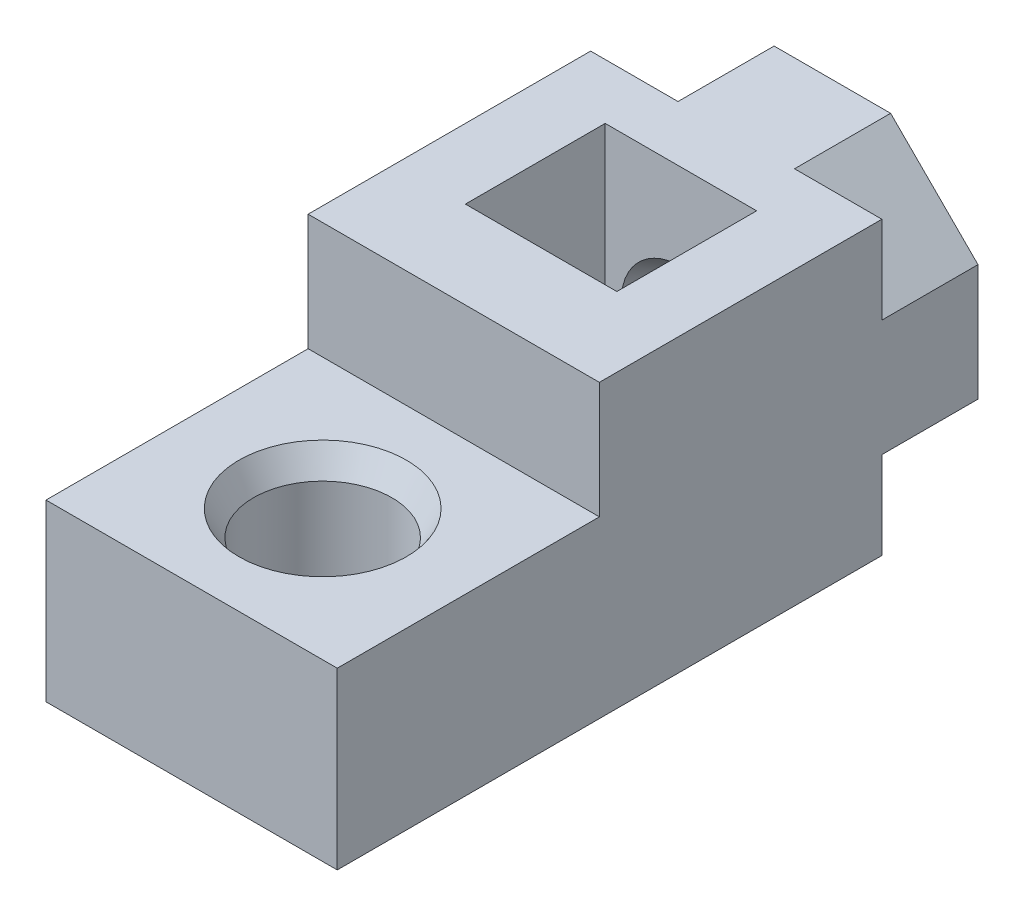
ISO-10303-21;
HEADER;
FILE_DESCRIPTION(('STEP AP214'),'2;1');
FILE_NAME('part.step','',(''),(''),'','','');
FILE_SCHEMA(('AUTOMOTIVE_DESIGN { 1 0 10303 214 1 1 1 1 }'));
ENDSEC;
DATA;
#1=APPLICATION_CONTEXT('core data for automotive mechanical design processes');
#2=APPLICATION_PROTOCOL_DEFINITION('international standard','automotive_design',2000,#1);
#3=PRODUCT_CONTEXT('',#1,'mechanical');
#4=PRODUCT('Part','Part','',(#3));
#5=PRODUCT_RELATED_PRODUCT_CATEGORY('part','',(#4));
#6=PRODUCT_DEFINITION_FORMATION('','',#4);
#7=PRODUCT_DEFINITION_CONTEXT('part definition',#1,'design');
#8=PRODUCT_DEFINITION('design','',#6,#7);
#9=PRODUCT_DEFINITION_SHAPE('','',#8);
#10=(LENGTH_UNIT() NAMED_UNIT(*) SI_UNIT(.MILLI.,.METRE.));
#11=(NAMED_UNIT(*) PLANE_ANGLE_UNIT() SI_UNIT($,.RADIAN.));
#12=(NAMED_UNIT(*) SI_UNIT($,.STERADIAN.) SOLID_ANGLE_UNIT());
#13=UNCERTAINTY_MEASURE_WITH_UNIT(LENGTH_MEASURE(1.E-05),#10,'distance_accuracy_value','');
#14=(GEOMETRIC_REPRESENTATION_CONTEXT(3) GLOBAL_UNCERTAINTY_ASSIGNED_CONTEXT((#13)) GLOBAL_UNIT_ASSIGNED_CONTEXT((#10,
#11,#12)) REPRESENTATION_CONTEXT('',''));
#15=CARTESIAN_POINT('',(0.,0.,0.));
#16=DIRECTION('',(0.,0.,1.));
#17=DIRECTION('',(1.,0.,0.));
#18=AXIS2_PLACEMENT_3D('',#15,#16,#17);
#19=CARTESIAN_POINT('',(0.,0.,22.));
#20=DIRECTION('',(0.,0.,1.));
#21=DIRECTION('',(1.,0.,0.));
#22=AXIS2_PLACEMENT_3D('',#19,#20,#21);
#23=PLANE('',#22);
#24=DIRECTION('',(0.,1.,0.));
#25=VECTOR('',#24,1.);
#26=CARTESIAN_POINT('',(5.,5.,22.));
#27=LINE('',#26,#25);
#28=CARTESIAN_POINT('',(5.,-5.,22.));
#29=VERTEX_POINT('',#28);
#30=CARTESIAN_POINT('',(5.,1.,22.));
#31=VERTEX_POINT('',#30);
#32=EDGE_CURVE('E320',#29,#31,#27,.T.);
#33=ORIENTED_EDGE('',*,*,#32,.T.);
#34=DIRECTION('',(1.,0.,0.));
#35=VECTOR('',#34,1.);
#36=CARTESIAN_POINT('',(5.,1.,22.));
#37=LINE('',#36,#35);
#38=CARTESIAN_POINT('',(-5.,1.,22.));
#39=VERTEX_POINT('',#38);
#40=EDGE_CURVE('E421',#39,#31,#37,.T.);
#41=ORIENTED_EDGE('',*,*,#40,.F.);
#42=DIRECTION('',(0.,-1.,0.));
#43=VECTOR('',#42,1.);
#44=CARTESIAN_POINT('',(-5.,5.,22.));
#45=LINE('',#44,#43);
#46=CARTESIAN_POINT('',(-5.,-5.,22.));
#47=VERTEX_POINT('',#46);
#48=EDGE_CURVE('E324',#39,#47,#45,.T.);
#49=ORIENTED_EDGE('',*,*,#48,.T.);
#50=DIRECTION('',(1.,0.,0.));
#51=VECTOR('',#50,1.);
#52=CARTESIAN_POINT('',(-5.,-5.,22.));
#53=LINE('',#52,#51);
#54=EDGE_CURVE('E199',#47,#29,#53,.T.);
#55=ORIENTED_EDGE('',*,*,#54,.T.);
#56=EDGE_LOOP('',(#33,#41,#49,#55));
#57=FACE_BOUND('',#56,.T.);
#58=ADVANCED_FACE('F41',(#57),#23,.T.);
#59=CARTESIAN_POINT('',(-5.,5.,22.));
#60=DIRECTION('',(0.,-1.,0.));
#61=DIRECTION('',(0.,0.,-1.));
#62=AXIS2_PLACEMENT_3D('',#59,#60,#61);
#63=PLANE('',#62);
#64=DIRECTION('',(1.,0.,0.));
#65=VECTOR('',#64,1.);
#66=CARTESIAN_POINT('',(2.,5.,3.3));
#67=LINE('',#66,#65);
#68=CARTESIAN_POINT('',(2.,5.,3.3));
#69=VERTEX_POINT('',#68);
#70=CARTESIAN_POINT('',(5.,5.,3.3));
#71=VERTEX_POINT('',#70);
#72=EDGE_CURVE('E375',#69,#71,#67,.T.);
#73=ORIENTED_EDGE('',*,*,#72,.F.);
#74=DIRECTION('',(0.,0.,-1.));
#75=VECTOR('',#74,1.);
#76=CARTESIAN_POINT('',(2.,5.,3.3));
#77=LINE('',#76,#75);
#78=CARTESIAN_POINT('',(2.,5.,0.));
#79=VERTEX_POINT('',#78);
#80=EDGE_CURVE('E357',#69,#79,#77,.T.);
#81=ORIENTED_EDGE('',*,*,#80,.T.);
#82=DIRECTION('',(-1.,0.,0.));
#83=VECTOR('',#82,1.);
#84=CARTESIAN_POINT('',(-5.,5.,0.));
#85=LINE('',#84,#83);
#86=CARTESIAN_POINT('',(-2.,5.,0.));
#87=VERTEX_POINT('',#86);
#88=EDGE_CURVE('E333',#79,#87,#85,.T.);
#89=ORIENTED_EDGE('',*,*,#88,.T.);
#90=DIRECTION('',(0.,0.,-1.));
#91=VECTOR('',#90,1.);
#92=CARTESIAN_POINT('',(-2.,5.,3.3));
#93=LINE('',#92,#91);
#94=CARTESIAN_POINT('',(-2.,5.,3.3));
#95=VERTEX_POINT('',#94);
#96=EDGE_CURVE('E58',#95,#87,#93,.T.);
#97=ORIENTED_EDGE('',*,*,#96,.F.);
#98=DIRECTION('',(1.,0.,0.));
#99=VECTOR('',#98,1.);
#100=CARTESIAN_POINT('',(-5.,5.,3.3));
#101=LINE('',#100,#99);
#102=CARTESIAN_POINT('',(-5.,5.,3.3));
#103=VERTEX_POINT('',#102);
#104=EDGE_CURVE('E393',#103,#95,#101,.T.);
#105=ORIENTED_EDGE('',*,*,#104,.F.);
#106=DIRECTION('',(0.,0.,-1.));
#107=VECTOR('',#106,1.);
#108=CARTESIAN_POINT('',(-5.,5.,22.));
#109=LINE('',#108,#107);
#110=CARTESIAN_POINT('',(-5.,5.,13.));
#111=VERTEX_POINT('',#110);
#112=EDGE_CURVE('E201',#111,#103,#109,.T.);
#113=ORIENTED_EDGE('',*,*,#112,.F.);
#114=DIRECTION('',(-1.,0.,0.));
#115=VECTOR('',#114,1.);
#116=CARTESIAN_POINT('',(5.,5.,13.));
#117=LINE('',#116,#115);
#118=CARTESIAN_POINT('',(5.,5.,13.));
#119=VERTEX_POINT('',#118);
#120=EDGE_CURVE('E407',#119,#111,#117,.T.);
#121=ORIENTED_EDGE('',*,*,#120,.F.);
#122=DIRECTION('',(0.,0.,-1.));
#123=VECTOR('',#122,1.);
#124=CARTESIAN_POINT('',(5.,5.,22.));
#125=LINE('',#124,#123);
#126=EDGE_CURVE('E207',#119,#71,#125,.T.);
#127=ORIENTED_EDGE('',*,*,#126,.T.);
#128=EDGE_LOOP('',(#73,#81,#89,#97,#105,#113,#121,#127));
#129=FACE_BOUND('',#128,.T.);
#130=DIRECTION('',(1.,0.,0.));
#131=VECTOR('',#130,1.);
#132=CARTESIAN_POINT('',(-5.,5.,10.));
#133=LINE('',#132,#131);
#134=CARTESIAN_POINT('',(-2.6,5.,10.));
#135=VERTEX_POINT('',#134);
#136=CARTESIAN_POINT('',(2.6,5.,10.));
#137=VERTEX_POINT('',#136);
#138=EDGE_CURVE('E228',#135,#137,#133,.T.);
#139=ORIENTED_EDGE('',*,*,#138,.F.);
#140=DIRECTION('',(0.,0.,-1.));
#141=VECTOR('',#140,1.);
#142=CARTESIAN_POINT('',(-2.6,5.,22.));
#143=LINE('',#142,#141);
#144=CARTESIAN_POINT('',(-2.6,5.,5.2));
#145=VERTEX_POINT('',#144);
#146=EDGE_CURVE('E220',#135,#145,#143,.T.);
#147=ORIENTED_EDGE('',*,*,#146,.T.);
#148=DIRECTION('',(1.,0.,0.));
#149=VECTOR('',#148,1.);
#150=CARTESIAN_POINT('',(-5.,5.,5.2));
#151=LINE('',#150,#149);
#152=CARTESIAN_POINT('',(2.6,5.,5.2));
#153=VERTEX_POINT('',#152);
#154=EDGE_CURVE('E216',#145,#153,#151,.T.);
#155=ORIENTED_EDGE('',*,*,#154,.T.);
#156=DIRECTION('',(0.,0.,1.));
#157=VECTOR('',#156,1.);
#158=CARTESIAN_POINT('',(2.6,5.,22.));
#159=LINE('',#158,#157);
#160=EDGE_CURVE('E224',#153,#137,#159,.T.);
#161=ORIENTED_EDGE('',*,*,#160,.T.);
#162=EDGE_LOOP('',(#139,#147,#155,#161));
#163=FACE_BOUND('',#162,.T.);
#164=ADVANCED_FACE('F446',(#129,#163),#63,.F.);
#165=CARTESIAN_POINT('',(5.,5.,22.));
#166=DIRECTION('',(-1.,0.,0.));
#167=DIRECTION('',(0.,-1.,0.));
#168=AXIS2_PLACEMENT_3D('',#165,#166,#167);
#169=PLANE('',#168);
#170=DIRECTION('',(0.,1.,0.));
#171=VECTOR('',#170,1.);
#172=CARTESIAN_POINT('',(5.,5.,0.));
#173=LINE('',#172,#171);
#174=CARTESIAN_POINT('',(5.,-2.,0.));
#175=VERTEX_POINT('',#174);
#176=CARTESIAN_POINT('',(5.,2.,0.));
#177=VERTEX_POINT('',#176);
#178=EDGE_CURVE('E316',#175,#177,#173,.T.);
#179=ORIENTED_EDGE('',*,*,#178,.T.);
#180=DIRECTION('',(0.,0.,-1.));
#181=VECTOR('',#180,1.);
#182=CARTESIAN_POINT('',(5.,2.,3.3));
#183=LINE('',#182,#181);
#184=CARTESIAN_POINT('',(5.,2.,3.3));
#185=VERTEX_POINT('',#184);
#186=EDGE_CURVE('E364',#185,#177,#183,.T.);
#187=ORIENTED_EDGE('',*,*,#186,.F.);
#188=DIRECTION('',(0.,-1.,0.));
#189=VECTOR('',#188,1.);
#190=CARTESIAN_POINT('',(5.,5.,3.3));
#191=LINE('',#190,#189);
#192=EDGE_CURVE('E378',#71,#185,#191,.T.);
#193=ORIENTED_EDGE('',*,*,#192,.F.);
#194=ORIENTED_EDGE('',*,*,#126,.F.);
#195=DIRECTION('',(0.,1.,0.));
#196=VECTOR('',#195,1.);
#197=CARTESIAN_POINT('',(5.,1.,13.));
#198=LINE('',#197,#196);
#199=CARTESIAN_POINT('',(5.,1.,13.));
#200=VERTEX_POINT('',#199);
#201=EDGE_CURVE('E303',#200,#119,#198,.T.);
#202=ORIENTED_EDGE('',*,*,#201,.F.);
#203=DIRECTION('',(0.,0.,-1.));
#204=VECTOR('',#203,1.);
#205=CARTESIAN_POINT('',(5.,1.,22.));
#206=LINE('',#205,#204);
#207=EDGE_CURVE('E410',#31,#200,#206,.T.);
#208=ORIENTED_EDGE('',*,*,#207,.F.);
#209=ORIENTED_EDGE('',*,*,#32,.F.);
#210=DIRECTION('',(0.,0.,-1.));
#211=VECTOR('',#210,1.);
#212=CARTESIAN_POINT('',(5.,-5.,22.));
#213=LINE('',#212,#211);
#214=CARTESIAN_POINT('',(5.,-5.,3.3));
#215=VERTEX_POINT('',#214);
#216=EDGE_CURVE('E202',#29,#215,#213,.T.);
#217=ORIENTED_EDGE('',*,*,#216,.T.);
#218=DIRECTION('',(0.,-1.,0.));
#219=VECTOR('',#218,1.);
#220=CARTESIAN_POINT('',(5.,-2.,3.3));
#221=LINE('',#220,#219);
#222=CARTESIAN_POINT('',(5.,-2.,3.3));
#223=VERTEX_POINT('',#222);
#224=EDGE_CURVE('E356',#223,#215,#221,.T.);
#225=ORIENTED_EDGE('',*,*,#224,.F.);
#226=DIRECTION('',(0.,0.,-1.));
#227=VECTOR('',#226,1.);
#228=CARTESIAN_POINT('',(5.,-2.,3.3));
#229=LINE('',#228,#227);
#230=EDGE_CURVE('E370',#223,#175,#229,.T.);
#231=ORIENTED_EDGE('',*,*,#230,.T.);
#232=EDGE_LOOP('',(#179,#187,#193,#194,#202,#208,#209,#217,#225,#231));
#233=FACE_BOUND('',#232,.T.);
#234=ADVANCED_FACE('F448',(#233),#169,.F.);
#235=CARTESIAN_POINT('',(-5.,5.,22.));
#236=DIRECTION('',(1.,0.,0.));
#237=DIRECTION('',(0.,1.,0.));
#238=AXIS2_PLACEMENT_3D('',#235,#236,#237);
#239=PLANE('',#238);
#240=DIRECTION('',(0.,-1.,0.));
#241=VECTOR('',#240,1.);
#242=CARTESIAN_POINT('',(-5.,5.,0.));
#243=LINE('',#242,#241);
#244=CARTESIAN_POINT('',(-5.,2.,0.));
#245=VERTEX_POINT('',#244);
#246=CARTESIAN_POINT('',(-5.,-2.,0.));
#247=VERTEX_POINT('',#246);
#248=EDGE_CURVE('E337',#245,#247,#243,.T.);
#249=ORIENTED_EDGE('',*,*,#248,.T.);
#250=DIRECTION('',(0.,0.,-1.));
#251=VECTOR('',#250,1.);
#252=CARTESIAN_POINT('',(-5.,-2.,3.3));
#253=LINE('',#252,#251);
#254=CARTESIAN_POINT('',(-5.,-2.,3.3));
#255=VERTEX_POINT('',#254);
#256=EDGE_CURVE('E66',#255,#247,#253,.T.);
#257=ORIENTED_EDGE('',*,*,#256,.F.);
#258=DIRECTION('',(0.,1.,0.));
#259=VECTOR('',#258,1.);
#260=CARTESIAN_POINT('',(-5.,-5.,3.3));
#261=LINE('',#260,#259);
#262=CARTESIAN_POINT('',(-5.,-5.,3.3));
#263=VERTEX_POINT('',#262);
#264=EDGE_CURVE('E179',#263,#255,#261,.T.);
#265=ORIENTED_EDGE('',*,*,#264,.F.);
#266=DIRECTION('',(0.,0.,-1.));
#267=VECTOR('',#266,1.);
#268=CARTESIAN_POINT('',(-5.,-5.,22.));
#269=LINE('',#268,#267);
#270=EDGE_CURVE('E192',#47,#263,#269,.T.);
#271=ORIENTED_EDGE('',*,*,#270,.F.);
#272=ORIENTED_EDGE('',*,*,#48,.F.);
#273=DIRECTION('',(0.,0.,1.));
#274=VECTOR('',#273,1.);
#275=CARTESIAN_POINT('',(-5.,1.,22.));
#276=LINE('',#275,#274);
#277=CARTESIAN_POINT('',(-5.,1.,13.));
#278=VERTEX_POINT('',#277);
#279=EDGE_CURVE('E418',#278,#39,#276,.T.);
#280=ORIENTED_EDGE('',*,*,#279,.F.);
#281=DIRECTION('',(0.,1.,0.));
#282=VECTOR('',#281,1.);
#283=CARTESIAN_POINT('',(-5.,1.,13.));
#284=LINE('',#283,#282);
#285=EDGE_CURVE('E299',#278,#111,#284,.T.);
#286=ORIENTED_EDGE('',*,*,#285,.T.);
#287=ORIENTED_EDGE('',*,*,#112,.T.);
#288=DIRECTION('',(0.,1.,0.));
#289=VECTOR('',#288,1.);
#290=CARTESIAN_POINT('',(-5.,2.,3.3));
#291=LINE('',#290,#289);
#292=CARTESIAN_POINT('',(-5.,2.,3.3));
#293=VERTEX_POINT('',#292);
#294=EDGE_CURVE('E390',#293,#103,#291,.T.);
#295=ORIENTED_EDGE('',*,*,#294,.F.);
#296=DIRECTION('',(0.,0.,-1.));
#297=VECTOR('',#296,1.);
#298=CARTESIAN_POINT('',(-5.,2.,3.3));
#299=LINE('',#298,#297);
#300=EDGE_CURVE('E403',#293,#245,#299,.T.);
#301=ORIENTED_EDGE('',*,*,#300,.T.);
#302=EDGE_LOOP('',(#249,#257,#265,#271,#272,#280,#286,#287,#295,#301));
#303=FACE_BOUND('',#302,.T.);
#304=ADVANCED_FACE('F190',(#303),#239,.F.);
#305=CARTESIAN_POINT('',(-5.,-5.,22.));
#306=DIRECTION('',(0.,1.,0.));
#307=DIRECTION('',(0.,0.,1.));
#308=AXIS2_PLACEMENT_3D('',#305,#306,#307);
#309=PLANE('',#308);
#310=CARTESIAN_POINT('',(0.,-5.,17.5));
#311=DIRECTION('',(0.,1.,0.));
#312=DIRECTION('',(0.,0.,1.));
#313=AXIS2_PLACEMENT_3D('',#310,#311,#312);
#314=CIRCLE('',#313,2.875);
#315=CARTESIAN_POINT('',(0.,-5.,20.375));
#316=VERTEX_POINT('',#315);
#317=EDGE_CURVE('E231',#316,#316,#314,.T.);
#318=ORIENTED_EDGE('',*,*,#317,.T.);
#319=EDGE_LOOP('',(#318));
#320=FACE_BOUND('',#319,.T.);
#321=DIRECTION('',(1.,0.,0.));
#322=VECTOR('',#321,1.);
#323=CARTESIAN_POINT('',(-5.,-5.,0.));
#324=LINE('',#323,#322);
#325=CARTESIAN_POINT('',(-2.,-5.,0.));
#326=VERTEX_POINT('',#325);
#327=CARTESIAN_POINT('',(2.,-5.,0.));
#328=VERTEX_POINT('',#327);
#329=EDGE_CURVE('E325',#326,#328,#324,.T.);
#330=ORIENTED_EDGE('',*,*,#329,.T.);
#331=DIRECTION('',(0.,0.,-1.));
#332=VECTOR('',#331,1.);
#333=CARTESIAN_POINT('',(2.,-5.,3.3));
#334=LINE('',#333,#332);
#335=CARTESIAN_POINT('',(2.,-5.,3.3));
#336=VERTEX_POINT('',#335);
#337=EDGE_CURVE('E343',#336,#328,#334,.T.);
#338=ORIENTED_EDGE('',*,*,#337,.F.);
#339=DIRECTION('',(-1.,0.,0.));
#340=VECTOR('',#339,1.);
#341=CARTESIAN_POINT('',(5.,-5.,3.3));
#342=LINE('',#341,#340);
#343=EDGE_CURVE('E361',#215,#336,#342,.T.);
#344=ORIENTED_EDGE('',*,*,#343,.F.);
#345=ORIENTED_EDGE('',*,*,#216,.F.);
#346=ORIENTED_EDGE('',*,*,#54,.F.);
#347=ORIENTED_EDGE('',*,*,#270,.T.);
#348=DIRECTION('',(-1.,0.,0.));
#349=VECTOR('',#348,1.);
#350=CARTESIAN_POINT('',(-2.,-5.,3.3));
#351=LINE('',#350,#349);
#352=CARTESIAN_POINT('',(-2.,-5.,3.3));
#353=VERTEX_POINT('',#352);
#354=EDGE_CURVE('E176',#353,#263,#351,.T.);
#355=ORIENTED_EDGE('',*,*,#354,.F.);
#356=DIRECTION('',(0.,0.,-1.));
#357=VECTOR('',#356,1.);
#358=CARTESIAN_POINT('',(-2.,-5.,3.3));
#359=LINE('',#358,#357);
#360=EDGE_CURVE('E344',#353,#326,#359,.T.);
#361=ORIENTED_EDGE('',*,*,#360,.T.);
#362=EDGE_LOOP('',(#330,#338,#344,#345,#346,#347,#355,#361));
#363=FACE_BOUND('',#362,.T.);
#364=ADVANCED_FACE('F197',(#320,#363),#309,.F.);
#365=CARTESIAN_POINT('',(0.,0.,0.));
#366=DIRECTION('',(0.,0.,1.));
#367=DIRECTION('',(1.,0.,0.));
#368=AXIS2_PLACEMENT_3D('',#365,#366,#367);
#369=PLANE('',#368);
#370=CARTESIAN_POINT('',(0.,0.,0.));
#371=DIRECTION('',(0.,0.,1.));
#372=DIRECTION('',(1.,0.,0.));
#373=AXIS2_PLACEMENT_3D('',#370,#371,#372);
#374=CIRCLE('',#373,2.05);
#375=CARTESIAN_POINT('',(2.05,0.,0.));
#376=VERTEX_POINT('',#375);
#377=EDGE_CURVE('E11',#376,#376,#374,.T.);
#378=ORIENTED_EDGE('',*,*,#377,.T.);
#379=EDGE_LOOP('',(#378));
#380=FACE_BOUND('',#379,.T.);
#381=ORIENTED_EDGE('',*,*,#88,.F.);
#382=DIRECTION('',(-0.707106781186548,0.707106781186547,0.));
#383=VECTOR('',#382,1.);
#384=CARTESIAN_POINT('',(5.,2.,0.));
#385=LINE('',#384,#383);
#386=EDGE_CURVE('E379',#177,#79,#385,.T.);
#387=ORIENTED_EDGE('',*,*,#386,.F.);
#388=ORIENTED_EDGE('',*,*,#178,.F.);
#389=DIRECTION('',(0.707106781186548,0.707106781186548,0.));
#390=VECTOR('',#389,1.);
#391=CARTESIAN_POINT('',(2.,-5.,0.));
#392=LINE('',#391,#390);
#393=EDGE_CURVE('E351',#328,#175,#392,.T.);
#394=ORIENTED_EDGE('',*,*,#393,.F.);
#395=ORIENTED_EDGE('',*,*,#329,.F.);
#396=DIRECTION('',(0.707106781186548,-0.707106781186548,0.));
#397=VECTOR('',#396,1.);
#398=CARTESIAN_POINT('',(-5.,-2.,0.));
#399=LINE('',#398,#397);
#400=EDGE_CURVE('E185',#247,#326,#399,.T.);
#401=ORIENTED_EDGE('',*,*,#400,.F.);
#402=ORIENTED_EDGE('',*,*,#248,.F.);
#403=DIRECTION('',(-0.707106781186548,-0.707106781186548,0.));
#404=VECTOR('',#403,1.);
#405=CARTESIAN_POINT('',(-2.,5.,0.));
#406=LINE('',#405,#404);
#407=EDGE_CURVE('E394',#87,#245,#406,.T.);
#408=ORIENTED_EDGE('',*,*,#407,.F.);
#409=EDGE_LOOP('',(#381,#387,#388,#394,#395,#401,#402,#408));
#410=FACE_BOUND('',#409,.T.);
#411=ADVANCED_FACE('F348',(#380,#410),#369,.F.);
#412=CARTESIAN_POINT('',(2.6,1.65421964841117,10.));
#413=DIRECTION('',(1.,0.,0.));
#414=DIRECTION('',(0.,1.,0.));
#415=AXIS2_PLACEMENT_3D('',#412,#413,#414);
#416=PLANE('',#415);
#417=DIRECTION('',(0.,-1.,0.));
#418=VECTOR('',#417,1.);
#419=CARTESIAN_POINT('',(2.6,1.65421964841117,5.2));
#420=LINE('',#419,#418);
#421=CARTESIAN_POINT('',(2.6,-1.50111069989303,5.2));
#422=VERTEX_POINT('',#421);
#423=EDGE_CURVE('E283',#153,#422,#420,.T.);
#424=ORIENTED_EDGE('',*,*,#423,.T.);
#425=DIRECTION('',(0.,0.,-1.));
#426=VECTOR('',#425,1.);
#427=CARTESIAN_POINT('',(2.6,-1.50111069989303,10.));
#428=LINE('',#427,#426);
#429=CARTESIAN_POINT('',(2.6,-1.50111069989303,10.));
#430=VERTEX_POINT('',#429);
#431=EDGE_CURVE('E294',#430,#422,#428,.T.);
#432=ORIENTED_EDGE('',*,*,#431,.F.);
#433=DIRECTION('',(0.,-1.,0.));
#434=VECTOR('',#433,1.);
#435=CARTESIAN_POINT('',(2.6,6.,10.));
#436=LINE('',#435,#434);
#437=EDGE_CURVE('E431',#137,#430,#436,.T.);
#438=ORIENTED_EDGE('',*,*,#437,.F.);
#439=ORIENTED_EDGE('',*,*,#160,.F.);
#440=EDGE_LOOP('',(#424,#432,#438,#439));
#441=FACE_BOUND('',#440,.T.);
#442=ADVANCED_FACE('F443',(#441),#416,.F.);
#443=CARTESIAN_POINT('',(-2.6,1.82300118851671,10.));
#444=DIRECTION('',(-1.,0.,0.));
#445=DIRECTION('',(0.,0.,1.));
#446=AXIS2_PLACEMENT_3D('',#443,#444,#445);
#447=PLANE('',#446);
#448=DIRECTION('',(0.,1.,0.));
#449=VECTOR('',#448,1.);
#450=CARTESIAN_POINT('',(-2.6,-1.50111069989303,10.));
#451=LINE('',#450,#449);
#452=CARTESIAN_POINT('',(-2.6,-1.50111069989303,10.));
#453=VERTEX_POINT('',#452);
#454=EDGE_CURVE('E289',#453,#135,#451,.T.);
#455=ORIENTED_EDGE('',*,*,#454,.F.);
#456=DIRECTION('',(0.,0.,-1.));
#457=VECTOR('',#456,1.);
#458=CARTESIAN_POINT('',(-2.6,-1.50111069989303,10.));
#459=LINE('',#458,#457);
#460=CARTESIAN_POINT('',(-2.6,-1.50111069989303,5.2));
#461=VERTEX_POINT('',#460);
#462=EDGE_CURVE('E286',#453,#461,#459,.T.);
#463=ORIENTED_EDGE('',*,*,#462,.T.);
#464=DIRECTION('',(0.,1.,0.));
#465=VECTOR('',#464,1.);
#466=CARTESIAN_POINT('',(-2.6,1.82300118851671,5.2));
#467=LINE('',#466,#465);
#468=EDGE_CURVE('E275',#461,#145,#467,.T.);
#469=ORIENTED_EDGE('',*,*,#468,.T.);
#470=ORIENTED_EDGE('',*,*,#146,.F.);
#471=EDGE_LOOP('',(#455,#463,#469,#470));
#472=FACE_BOUND('',#471,.T.);
#473=ADVANCED_FACE('F287',(#472),#447,.F.);
#474=CARTESIAN_POINT('',(0.,0.,10.));
#475=DIRECTION('',(0.,0.,-1.));
#476=DIRECTION('',(-1.,0.,0.));
#477=AXIS2_PLACEMENT_3D('',#474,#475,#476);
#478=PLANE('',#477);
#479=ORIENTED_EDGE('',*,*,#138,.T.);
#480=ORIENTED_EDGE('',*,*,#437,.T.);
#481=DIRECTION('',(-0.866025403784439,-0.5,0.));
#482=VECTOR('',#481,1.);
#483=CARTESIAN_POINT('',(2.6,-1.50111069989303,10.));
#484=LINE('',#483,#482);
#485=CARTESIAN_POINT('',(0.,-3.00222139978605,10.));
#486=VERTEX_POINT('',#485);
#487=EDGE_CURVE('E295',#430,#486,#484,.T.);
#488=ORIENTED_EDGE('',*,*,#487,.T.);
#489=DIRECTION('',(-0.866025403784438,0.5,0.));
#490=VECTOR('',#489,1.);
#491=CARTESIAN_POINT('',(0.,-3.00222139978605,10.));
#492=LINE('',#491,#490);
#493=EDGE_CURVE('E313',#486,#453,#492,.T.);
#494=ORIENTED_EDGE('',*,*,#493,.T.);
#495=ORIENTED_EDGE('',*,*,#454,.T.);
#496=EDGE_LOOP('',(#479,#480,#488,#494,#495));
#497=FACE_BOUND('',#496,.T.);
#498=ADVANCED_FACE('F271',(#497),#478,.T.);
#499=CARTESIAN_POINT('',(0.,0.,5.2));
#500=DIRECTION('',(0.,0.,-1.));
#501=DIRECTION('',(-1.,0.,0.));
#502=AXIS2_PLACEMENT_3D('',#499,#500,#501);
#503=PLANE('',#502);
#504=CARTESIAN_POINT('',(0.,0.,5.2));
#505=DIRECTION('',(0.,0.,-1.));
#506=DIRECTION('',(-1.,0.,0.));
#507=AXIS2_PLACEMENT_3D('',#504,#505,#506);
#508=CIRCLE('',#507,2.05);
#509=CARTESIAN_POINT('',(-2.05,0.,5.2));
#510=VERTEX_POINT('',#509);
#511=EDGE_CURVE('E247',#510,#510,#508,.T.);
#512=ORIENTED_EDGE('',*,*,#511,.T.);
#513=EDGE_LOOP('',(#512));
#514=FACE_BOUND('',#513,.T.);
#515=ORIENTED_EDGE('',*,*,#468,.F.);
#516=DIRECTION('',(-0.866025403784438,0.5,0.));
#517=VECTOR('',#516,1.);
#518=CARTESIAN_POINT('',(0.,-3.00222139978605,5.2));
#519=LINE('',#518,#517);
#520=CARTESIAN_POINT('',(0.,-3.00222139978605,5.2));
#521=VERTEX_POINT('',#520);
#522=EDGE_CURVE('E279',#521,#461,#519,.T.);
#523=ORIENTED_EDGE('',*,*,#522,.F.);
#524=DIRECTION('',(-0.866025403784439,-0.5,0.));
#525=VECTOR('',#524,1.);
#526=CARTESIAN_POINT('',(2.6,-1.50111069989303,5.2));
#527=LINE('',#526,#525);
#528=EDGE_CURVE('E310',#422,#521,#527,.T.);
#529=ORIENTED_EDGE('',*,*,#528,.F.);
#530=ORIENTED_EDGE('',*,*,#423,.F.);
#531=ORIENTED_EDGE('',*,*,#154,.F.);
#532=EDGE_LOOP('',(#515,#523,#529,#530,#531));
#533=FACE_BOUND('',#532,.T.);
#534=ADVANCED_FACE('F267',(#514,#533),#503,.F.);
#535=CARTESIAN_POINT('',(0.,-3.00222139978605,10.));
#536=DIRECTION('',(-0.5,-0.866025403784438,0.));
#537=DIRECTION('',(0.866025403784439,-0.5,0.));
#538=AXIS2_PLACEMENT_3D('',#535,#536,#537);
#539=PLANE('',#538);
#540=ORIENTED_EDGE('',*,*,#522,.T.);
#541=ORIENTED_EDGE('',*,*,#462,.F.);
#542=ORIENTED_EDGE('',*,*,#493,.F.);
#543=DIRECTION('',(0.,0.,-1.));
#544=VECTOR('',#543,1.);
#545=CARTESIAN_POINT('',(0.,-3.00222139978605,10.));
#546=LINE('',#545,#544);
#547=EDGE_CURVE('E297',#486,#521,#546,.T.);
#548=ORIENTED_EDGE('',*,*,#547,.T.);
#549=EDGE_LOOP('',(#540,#541,#542,#548));
#550=FACE_BOUND('',#549,.T.);
#551=ADVANCED_FACE('F270',(#550),#539,.F.);
#552=CARTESIAN_POINT('',(2.6,-1.50111069989303,10.));
#553=DIRECTION('',(0.5,-0.866025403784439,0.));
#554=DIRECTION('',(0.866025403784439,0.5,0.));
#555=AXIS2_PLACEMENT_3D('',#552,#553,#554);
#556=PLANE('',#555);
#557=ORIENTED_EDGE('',*,*,#528,.T.);
#558=ORIENTED_EDGE('',*,*,#547,.F.);
#559=ORIENTED_EDGE('',*,*,#487,.F.);
#560=ORIENTED_EDGE('',*,*,#431,.T.);
#561=EDGE_LOOP('',(#557,#558,#559,#560));
#562=FACE_BOUND('',#561,.T.);
#563=ADVANCED_FACE('F440',(#562),#556,.F.);
#564=CARTESIAN_POINT('',(0.,0.,14.3840620433566));
#565=DIRECTION('',(0.,0.,-1.));
#566=DIRECTION('',(-1.,0.,0.));
#567=AXIS2_PLACEMENT_3D('',#564,#565,#566);
#568=CYLINDRICAL_SURFACE('',#567,1.55);
#569=CARTESIAN_POINT('',(0.,0.,4.33397459621556));
#570=DIRECTION('',(0.,0.,-1.));
#571=DIRECTION('',(-1.,0.,0.));
#572=AXIS2_PLACEMENT_3D('',#569,#570,#571);
#573=CIRCLE('',#572,1.55);
#574=CARTESIAN_POINT('',(-1.55,0.,4.33397459621556));
#575=VERTEX_POINT('',#574);
#576=EDGE_CURVE('E51',#575,#575,#573,.F.);
#577=ORIENTED_EDGE('',*,*,#576,.T.);
#578=EDGE_LOOP('',(#577));
#579=FACE_BOUND('',#578,.T.);
#580=CARTESIAN_POINT('',(0.,0.,0.866025403784436));
#581=DIRECTION('',(0.,0.,1.));
#582=DIRECTION('',(1.,0.,0.));
#583=AXIS2_PLACEMENT_3D('',#580,#581,#582);
#584=CIRCLE('',#583,1.55);
#585=CARTESIAN_POINT('',(1.55,0.,0.866025403784436));
#586=VERTEX_POINT('',#585);
#587=EDGE_CURVE('E251',#586,#586,#584,.F.);
#588=ORIENTED_EDGE('',*,*,#587,.T.);
#589=EDGE_LOOP('',(#588));
#590=FACE_BOUND('',#589,.T.);
#591=ADVANCED_FACE('F258',(#579,#590),#568,.F.);
#592=CARTESIAN_POINT('',(5.,1.,13.));
#593=DIRECTION('',(0.,0.,-1.));
#594=DIRECTION('',(-1.,0.,0.));
#595=AXIS2_PLACEMENT_3D('',#592,#593,#594);
#596=PLANE('',#595);
#597=ORIENTED_EDGE('',*,*,#120,.T.);
#598=ORIENTED_EDGE('',*,*,#285,.F.);
#599=DIRECTION('',(-1.,0.,0.));
#600=VECTOR('',#599,1.);
#601=CARTESIAN_POINT('',(5.,1.,13.));
#602=LINE('',#601,#600);
#603=EDGE_CURVE('E414',#200,#278,#602,.T.);
#604=ORIENTED_EDGE('',*,*,#603,.F.);
#605=ORIENTED_EDGE('',*,*,#201,.T.);
#606=EDGE_LOOP('',(#597,#598,#604,#605));
#607=FACE_BOUND('',#606,.T.);
#608=ADVANCED_FACE('F499',(#607),#596,.F.);
#609=CARTESIAN_POINT('',(0.,1.,0.));
#610=DIRECTION('',(0.,1.,0.));
#611=DIRECTION('',(0.,0.,1.));
#612=AXIS2_PLACEMENT_3D('',#609,#610,#611);
#613=PLANE('',#612);
#614=CARTESIAN_POINT('',(0.,1.,17.5));
#615=DIRECTION('',(0.,1.,0.));
#616=DIRECTION('',(0.,0.,1.));
#617=AXIS2_PLACEMENT_3D('',#614,#615,#616);
#618=CIRCLE('',#617,2.875);
#619=CARTESIAN_POINT('',(0.,1.,20.375));
#620=VERTEX_POINT('',#619);
#621=EDGE_CURVE('E243',#620,#620,#618,.F.);
#622=ORIENTED_EDGE('',*,*,#621,.T.);
#623=EDGE_LOOP('',(#622));
#624=FACE_BOUND('',#623,.T.);
#625=ORIENTED_EDGE('',*,*,#207,.T.);
#626=ORIENTED_EDGE('',*,*,#603,.T.);
#627=ORIENTED_EDGE('',*,*,#279,.T.);
#628=ORIENTED_EDGE('',*,*,#40,.T.);
#629=EDGE_LOOP('',(#625,#626,#627,#628));
#630=FACE_BOUND('',#629,.T.);
#631=ADVANCED_FACE('F490',(#624,#630),#613,.T.);
#632=CARTESIAN_POINT('',(0.,-5.,17.5));
#633=DIRECTION('',(0.,1.,0.));
#634=DIRECTION('',(0.,0.,1.));
#635=AXIS2_PLACEMENT_3D('',#632,#633,#634);
#636=CYLINDRICAL_SURFACE('',#635,2.375);
#637=CARTESIAN_POINT('',(0.,-4.13397459621557,17.5));
#638=DIRECTION('',(0.,1.,0.));
#639=DIRECTION('',(0.,0.,1.));
#640=AXIS2_PLACEMENT_3D('',#637,#638,#639);
#641=CIRCLE('',#640,2.375);
#642=CARTESIAN_POINT('',(0.,-4.13397459621557,19.875));
#643=VERTEX_POINT('',#642);
#644=EDGE_CURVE('E239',#643,#643,#641,.F.);
#645=ORIENTED_EDGE('',*,*,#644,.T.);
#646=EDGE_LOOP('',(#645));
#647=FACE_BOUND('',#646,.T.);
#648=CARTESIAN_POINT('',(0.,0.133974596215572,17.5));
#649=DIRECTION('',(0.,1.,0.));
#650=DIRECTION('',(0.,0.,1.));
#651=AXIS2_PLACEMENT_3D('',#648,#649,#650);
#652=CIRCLE('',#651,2.375);
#653=CARTESIAN_POINT('',(0.,0.133974596215572,19.875));
#654=VERTEX_POINT('',#653);
#655=EDGE_CURVE('E235',#654,#654,#652,.T.);
#656=ORIENTED_EDGE('',*,*,#655,.T.);
#657=EDGE_LOOP('',(#656));
#658=FACE_BOUND('',#657,.T.);
#659=ADVANCED_FACE('F487',(#647,#658),#636,.F.);
#660=CARTESIAN_POINT('',(-2.,5.,3.3));
#661=DIRECTION('',(0.707106781186548,-0.707106781186548,0.));
#662=DIRECTION('',(0.707106781186548,0.707106781186548,0.));
#663=AXIS2_PLACEMENT_3D('',#660,#661,#662);
#664=PLANE('',#663);
#665=ORIENTED_EDGE('',*,*,#407,.T.);
#666=ORIENTED_EDGE('',*,*,#300,.F.);
#667=DIRECTION('',(-0.707106781186548,-0.707106781186548,0.));
#668=VECTOR('',#667,1.);
#669=CARTESIAN_POINT('',(-2.,5.,3.3));
#670=LINE('',#669,#668);
#671=EDGE_CURVE('E397',#95,#293,#670,.T.);
#672=ORIENTED_EDGE('',*,*,#671,.F.);
#673=ORIENTED_EDGE('',*,*,#96,.T.);
#674=EDGE_LOOP('',(#665,#666,#672,#673));
#675=FACE_BOUND('',#674,.T.);
#676=ADVANCED_FACE('F489',(#675),#664,.F.);
#677=CARTESIAN_POINT('',(0.,0.,3.3));
#678=DIRECTION('',(0.,0.,-1.));
#679=DIRECTION('',(-1.,0.,0.));
#680=AXIS2_PLACEMENT_3D('',#677,#678,#679);
#681=PLANE('',#680);
#682=ORIENTED_EDGE('',*,*,#294,.T.);
#683=ORIENTED_EDGE('',*,*,#104,.T.);
#684=ORIENTED_EDGE('',*,*,#671,.T.);
#685=EDGE_LOOP('',(#682,#683,#684));
#686=FACE_BOUND('',#685,.T.);
#687=ADVANCED_FACE('F497',(#686),#681,.T.);
#688=CARTESIAN_POINT('',(-5.,-2.,3.3));
#689=DIRECTION('',(0.707106781186548,0.707106781186548,0.));
#690=DIRECTION('',(-0.707106781186548,0.707106781186548,0.));
#691=AXIS2_PLACEMENT_3D('',#688,#689,#690);
#692=PLANE('',#691);
#693=ORIENTED_EDGE('',*,*,#400,.T.);
#694=ORIENTED_EDGE('',*,*,#360,.F.);
#695=DIRECTION('',(0.707106781186548,-0.707106781186548,0.));
#696=VECTOR('',#695,1.);
#697=CARTESIAN_POINT('',(-5.,-2.,3.3));
#698=LINE('',#697,#696);
#699=EDGE_CURVE('E180',#255,#353,#698,.T.);
#700=ORIENTED_EDGE('',*,*,#699,.F.);
#701=ORIENTED_EDGE('',*,*,#256,.T.);
#702=EDGE_LOOP('',(#693,#694,#700,#701));
#703=FACE_BOUND('',#702,.T.);
#704=ADVANCED_FACE('F679',(#703),#692,.F.);
#705=CARTESIAN_POINT('',(0.,0.,3.3));
#706=DIRECTION('',(0.,0.,-1.));
#707=DIRECTION('',(-1.,0.,0.));
#708=AXIS2_PLACEMENT_3D('',#705,#706,#707);
#709=PLANE('',#708);
#710=ORIENTED_EDGE('',*,*,#354,.T.);
#711=ORIENTED_EDGE('',*,*,#264,.T.);
#712=ORIENTED_EDGE('',*,*,#699,.T.);
#713=EDGE_LOOP('',(#710,#711,#712));
#714=FACE_BOUND('',#713,.T.);
#715=ADVANCED_FACE('F178',(#714),#709,.T.);
#716=CARTESIAN_POINT('',(2.,-5.,3.3));
#717=DIRECTION('',(-0.707106781186548,0.707106781186548,0.));
#718=DIRECTION('',(-0.707106781186548,-0.707106781186548,0.));
#719=AXIS2_PLACEMENT_3D('',#716,#717,#718);
#720=PLANE('',#719);
#721=ORIENTED_EDGE('',*,*,#393,.T.);
#722=ORIENTED_EDGE('',*,*,#230,.F.);
#723=DIRECTION('',(0.707106781186548,0.707106781186548,0.));
#724=VECTOR('',#723,1.);
#725=CARTESIAN_POINT('',(2.,-5.,3.3));
#726=LINE('',#725,#724);
#727=EDGE_CURVE('E368',#336,#223,#726,.T.);
#728=ORIENTED_EDGE('',*,*,#727,.F.);
#729=ORIENTED_EDGE('',*,*,#337,.T.);
#730=EDGE_LOOP('',(#721,#722,#728,#729));
#731=FACE_BOUND('',#730,.T.);
#732=ADVANCED_FACE('F665',(#731),#720,.F.);
#733=CARTESIAN_POINT('',(0.,0.,3.3));
#734=DIRECTION('',(0.,0.,-1.));
#735=DIRECTION('',(-1.,0.,0.));
#736=AXIS2_PLACEMENT_3D('',#733,#734,#735);
#737=PLANE('',#736);
#738=ORIENTED_EDGE('',*,*,#224,.T.);
#739=ORIENTED_EDGE('',*,*,#343,.T.);
#740=ORIENTED_EDGE('',*,*,#727,.T.);
#741=EDGE_LOOP('',(#738,#739,#740));
#742=FACE_BOUND('',#741,.T.);
#743=ADVANCED_FACE('F657',(#742),#737,.T.);
#744=CARTESIAN_POINT('',(5.,2.,3.3));
#745=DIRECTION('',(-0.707106781186547,-0.707106781186548,0.));
#746=DIRECTION('',(0.707106781186548,-0.707106781186547,0.));
#747=AXIS2_PLACEMENT_3D('',#744,#745,#746);
#748=PLANE('',#747);
#749=ORIENTED_EDGE('',*,*,#386,.T.);
#750=ORIENTED_EDGE('',*,*,#80,.F.);
#751=DIRECTION('',(-0.707106781186548,0.707106781186547,0.));
#752=VECTOR('',#751,1.);
#753=CARTESIAN_POINT('',(5.,2.,3.3));
#754=LINE('',#753,#752);
#755=EDGE_CURVE('E382',#185,#69,#754,.T.);
#756=ORIENTED_EDGE('',*,*,#755,.F.);
#757=ORIENTED_EDGE('',*,*,#186,.T.);
#758=EDGE_LOOP('',(#749,#750,#756,#757));
#759=FACE_BOUND('',#758,.T.);
#760=ADVANCED_FACE('F650',(#759),#748,.F.);
#761=CARTESIAN_POINT('',(0.,0.,3.3));
#762=DIRECTION('',(0.,0.,-1.));
#763=DIRECTION('',(-1.,0.,0.));
#764=AXIS2_PLACEMENT_3D('',#761,#762,#763);
#765=PLANE('',#764);
#766=ORIENTED_EDGE('',*,*,#72,.T.);
#767=ORIENTED_EDGE('',*,*,#192,.T.);
#768=ORIENTED_EDGE('',*,*,#755,.T.);
#769=EDGE_LOOP('',(#766,#767,#768));
#770=FACE_BOUND('',#769,.T.);
#771=ADVANCED_FACE('F470',(#770),#765,.T.);
#772=CARTESIAN_POINT('',(0.,-5.,17.5));
#773=DIRECTION('',(0.,-1.,0.));
#774=DIRECTION('',(0.,0.,-1.));
#775=AXIS2_PLACEMENT_3D('',#772,#773,#774);
#776=CONICAL_SURFACE('',#775,2.875,0.5235987755983);
#777=ORIENTED_EDGE('',*,*,#644,.F.);
#778=EDGE_LOOP('',(#777));
#779=FACE_BOUND('',#778,.T.);
#780=ORIENTED_EDGE('',*,*,#317,.F.);
#781=EDGE_LOOP('',(#780));
#782=FACE_BOUND('',#781,.T.);
#783=ADVANCED_FACE('F464',(#779,#782),#776,.F.);
#784=CARTESIAN_POINT('',(0.,0.133974596215572,17.5));
#785=DIRECTION('',(0.,1.,0.));
#786=DIRECTION('',(0.,0.,1.));
#787=AXIS2_PLACEMENT_3D('',#784,#785,#786);
#788=CONICAL_SURFACE('',#787,2.375,0.5235987755983);
#789=ORIENTED_EDGE('',*,*,#621,.F.);
#790=EDGE_LOOP('',(#789));
#791=FACE_BOUND('',#790,.T.);
#792=ORIENTED_EDGE('',*,*,#655,.F.);
#793=EDGE_LOOP('',(#792));
#794=FACE_BOUND('',#793,.T.);
#795=ADVANCED_FACE('F264',(#791,#794),#788,.F.);
#796=CARTESIAN_POINT('',(0.,0.,5.2));
#797=DIRECTION('',(0.,0.,1.));
#798=DIRECTION('',(1.,0.,0.));
#799=AXIS2_PLACEMENT_3D('',#796,#797,#798);
#800=CONICAL_SURFACE('',#799,2.05,0.5235987755983);
#801=ORIENTED_EDGE('',*,*,#576,.F.);
#802=EDGE_LOOP('',(#801));
#803=FACE_BOUND('',#802,.T.);
#804=ORIENTED_EDGE('',*,*,#511,.F.);
#805=EDGE_LOOP('',(#804));
#806=FACE_BOUND('',#805,.T.);
#807=ADVANCED_FACE('F261',(#803,#806),#800,.F.);
#808=CARTESIAN_POINT('',(0.,0.,0.866025403784436));
#809=DIRECTION('',(0.,0.,-1.));
#810=DIRECTION('',(-1.,0.,0.));
#811=AXIS2_PLACEMENT_3D('',#808,#809,#810);
#812=CONICAL_SURFACE('',#811,1.55,0.523598775598299);
#813=ORIENTED_EDGE('',*,*,#377,.F.);
#814=EDGE_LOOP('',(#813));
#815=FACE_BOUND('',#814,.T.);
#816=ORIENTED_EDGE('',*,*,#587,.F.);
#817=EDGE_LOOP('',(#816));
#818=FACE_BOUND('',#817,.T.);
#819=ADVANCED_FACE('F44',(#815,#818),#812,.F.);
#820=CLOSED_SHELL('',(#58,#164,#234,#304,#364,#411,#442,#473,#498,#534,#551,#563,#591,#608,#631,
#659,#676,#687,#704,#715,#732,#743,#760,#771,#783,#795,#807,#819));
#821=MANIFOLD_SOLID_BREP('B2',#820);
#822=ADVANCED_BREP_SHAPE_REPRESENTATION('',(#18,#821),#14);
#823=SHAPE_DEFINITION_REPRESENTATION(#9,#822);
ENDSEC;
END-ISO-10303-21;
